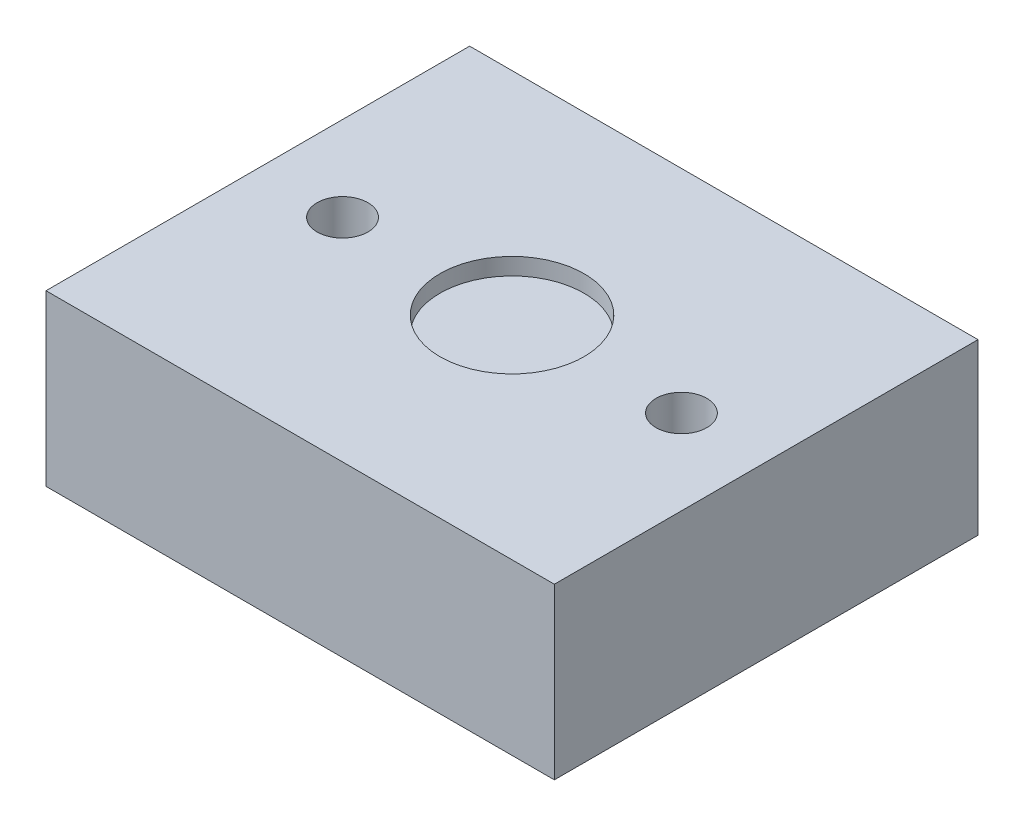
ISO-10303-21;
HEADER;
FILE_DESCRIPTION(('STEP AP214'),'2;1');
FILE_NAME('part.step','',(''),(''),'','','');
FILE_SCHEMA(('AUTOMOTIVE_DESIGN { 1 0 10303 214 1 1 1 1 }'));
ENDSEC;
DATA;
#1=APPLICATION_CONTEXT('core data for automotive mechanical design processes');
#2=APPLICATION_PROTOCOL_DEFINITION('international standard','automotive_design',2000,#1);
#3=PRODUCT_CONTEXT('',#1,'mechanical');
#4=PRODUCT('Part','Part','',(#3));
#5=PRODUCT_RELATED_PRODUCT_CATEGORY('part','',(#4));
#6=PRODUCT_DEFINITION_FORMATION('','',#4);
#7=PRODUCT_DEFINITION_CONTEXT('part definition',#1,'design');
#8=PRODUCT_DEFINITION('design','',#6,#7);
#9=PRODUCT_DEFINITION_SHAPE('','',#8);
#10=(LENGTH_UNIT() NAMED_UNIT(*) SI_UNIT(.MILLI.,.METRE.));
#11=(NAMED_UNIT(*) PLANE_ANGLE_UNIT() SI_UNIT($,.RADIAN.));
#12=(NAMED_UNIT(*) SI_UNIT($,.STERADIAN.) SOLID_ANGLE_UNIT());
#13=UNCERTAINTY_MEASURE_WITH_UNIT(LENGTH_MEASURE(1.E-05),#10,'distance_accuracy_value','');
#14=(GEOMETRIC_REPRESENTATION_CONTEXT(3) GLOBAL_UNCERTAINTY_ASSIGNED_CONTEXT((#13)) GLOBAL_UNIT_ASSIGNED_CONTEXT((#10,
#11,#12)) REPRESENTATION_CONTEXT('',''));
#15=CARTESIAN_POINT('',(0.,0.,0.));
#16=DIRECTION('',(0.,0.,1.));
#17=DIRECTION('',(1.,0.,0.));
#18=AXIS2_PLACEMENT_3D('',#15,#16,#17);
#19=CARTESIAN_POINT('',(0.,10.,0.));
#20=DIRECTION('',(0.,-1.,0.));
#21=DIRECTION('',(0.,0.,-1.));
#22=AXIS2_PLACEMENT_3D('',#19,#20,#21);
#23=PLANE('',#22);
#24=CARTESIAN_POINT('',(0.,10.,0.));
#25=DIRECTION('',(0.,1.,0.));
#26=DIRECTION('',(0.,0.,1.));
#27=AXIS2_PLACEMENT_3D('',#24,#25,#26);
#28=CIRCLE('',#27,4.25);
#29=CARTESIAN_POINT('',(0.,10.,4.25));
#30=VERTEX_POINT('',#29);
#31=EDGE_CURVE('E146',#30,#30,#28,.T.);
#32=ORIENTED_EDGE('',*,*,#31,.F.);
#33=EDGE_LOOP('',(#32));
#34=FACE_BOUND('',#33,.T.);
#35=DIRECTION('',(0.,0.,-1.));
#36=VECTOR('',#35,1.);
#37=CARTESIAN_POINT('',(15.,10.,12.5));
#38=LINE('',#37,#36);
#39=CARTESIAN_POINT('',(15.,10.,12.5));
#40=VERTEX_POINT('',#39);
#41=CARTESIAN_POINT('',(15.,10.,-12.5));
#42=VERTEX_POINT('',#41);
#43=EDGE_CURVE('E92',#40,#42,#38,.T.);
#44=ORIENTED_EDGE('',*,*,#43,.T.);
#45=DIRECTION('',(-1.,0.,0.));
#46=VECTOR('',#45,1.);
#47=CARTESIAN_POINT('',(-15.,10.,-12.5));
#48=LINE('',#47,#46);
#49=CARTESIAN_POINT('',(-15.,10.,-12.5));
#50=VERTEX_POINT('',#49);
#51=EDGE_CURVE('E87',#42,#50,#48,.T.);
#52=ORIENTED_EDGE('',*,*,#51,.T.);
#53=DIRECTION('',(0.,0.,1.));
#54=VECTOR('',#53,1.);
#55=CARTESIAN_POINT('',(-15.,10.,12.5));
#56=LINE('',#55,#54);
#57=CARTESIAN_POINT('',(-15.,10.,12.5));
#58=VERTEX_POINT('',#57);
#59=EDGE_CURVE('E90',#50,#58,#56,.T.);
#60=ORIENTED_EDGE('',*,*,#59,.T.);
#61=DIRECTION('',(1.,0.,0.));
#62=VECTOR('',#61,1.);
#63=CARTESIAN_POINT('',(-15.,10.,12.5));
#64=LINE('',#63,#62);
#65=EDGE_CURVE('E57',#58,#40,#64,.T.);
#66=ORIENTED_EDGE('',*,*,#65,.T.);
#67=EDGE_LOOP('',(#44,#52,#60,#66));
#68=FACE_BOUND('',#67,.T.);
#69=CARTESIAN_POINT('',(10.,10.,0.));
#70=DIRECTION('',(0.,1.,0.));
#71=DIRECTION('',(0.,0.,1.));
#72=AXIS2_PLACEMENT_3D('',#69,#70,#71);
#73=CIRCLE('',#72,1.5);
#74=CARTESIAN_POINT('',(10.,10.,1.5));
#75=VERTEX_POINT('',#74);
#76=EDGE_CURVE('E112',#75,#75,#73,.T.);
#77=ORIENTED_EDGE('',*,*,#76,.F.);
#78=EDGE_LOOP('',(#77));
#79=FACE_BOUND('',#78,.T.);
#80=CARTESIAN_POINT('',(-10.,10.,0.));
#81=DIRECTION('',(0.,1.,0.));
#82=DIRECTION('',(0.,0.,1.));
#83=AXIS2_PLACEMENT_3D('',#80,#81,#82);
#84=CIRCLE('',#83,1.5);
#85=CARTESIAN_POINT('',(-10.,10.,1.5));
#86=VERTEX_POINT('',#85);
#87=EDGE_CURVE('E134',#86,#86,#84,.T.);
#88=ORIENTED_EDGE('',*,*,#87,.F.);
#89=EDGE_LOOP('',(#88));
#90=FACE_BOUND('',#89,.T.);
#91=ADVANCED_FACE('F39',(#34,#68,#79,#90),#23,.F.);
#92=CARTESIAN_POINT('',(0.,0.,0.));
#93=DIRECTION('',(0.,-1.,0.));
#94=DIRECTION('',(0.,0.,-1.));
#95=AXIS2_PLACEMENT_3D('',#92,#93,#94);
#96=PLANE('',#95);
#97=CARTESIAN_POINT('',(10.,0.,0.));
#98=DIRECTION('',(0.,1.,0.));
#99=DIRECTION('',(0.,0.,1.));
#100=AXIS2_PLACEMENT_3D('',#97,#98,#99);
#101=CIRCLE('',#100,1.5);
#102=CARTESIAN_POINT('',(10.,0.,1.5));
#103=VERTEX_POINT('',#102);
#104=EDGE_CURVE('E130',#103,#103,#101,.T.);
#105=ORIENTED_EDGE('',*,*,#104,.T.);
#106=EDGE_LOOP('',(#105));
#107=FACE_BOUND('',#106,.T.);
#108=DIRECTION('',(0.,0.,-1.));
#109=VECTOR('',#108,1.);
#110=CARTESIAN_POINT('',(15.,0.,12.5));
#111=LINE('',#110,#109);
#112=CARTESIAN_POINT('',(15.,0.,12.5));
#113=VERTEX_POINT('',#112);
#114=CARTESIAN_POINT('',(15.,0.,-12.5));
#115=VERTEX_POINT('',#114);
#116=EDGE_CURVE('E108',#113,#115,#111,.T.);
#117=ORIENTED_EDGE('',*,*,#116,.F.);
#118=DIRECTION('',(1.,0.,0.));
#119=VECTOR('',#118,1.);
#120=CARTESIAN_POINT('',(-15.,0.,12.5));
#121=LINE('',#120,#119);
#122=CARTESIAN_POINT('',(-15.,0.,12.5));
#123=VERTEX_POINT('',#122);
#124=EDGE_CURVE('E80',#123,#113,#121,.T.);
#125=ORIENTED_EDGE('',*,*,#124,.F.);
#126=DIRECTION('',(0.,0.,1.));
#127=VECTOR('',#126,1.);
#128=CARTESIAN_POINT('',(-15.,0.,12.5));
#129=LINE('',#128,#127);
#130=CARTESIAN_POINT('',(-15.,0.,-12.5));
#131=VERTEX_POINT('',#130);
#132=EDGE_CURVE('E74',#131,#123,#129,.T.);
#133=ORIENTED_EDGE('',*,*,#132,.F.);
#134=DIRECTION('',(-1.,0.,0.));
#135=VECTOR('',#134,1.);
#136=CARTESIAN_POINT('',(-15.,0.,-12.5));
#137=LINE('',#136,#135);
#138=EDGE_CURVE('E97',#115,#131,#137,.T.);
#139=ORIENTED_EDGE('',*,*,#138,.F.);
#140=EDGE_LOOP('',(#117,#125,#133,#139));
#141=FACE_BOUND('',#140,.T.);
#142=CARTESIAN_POINT('',(-10.,0.,0.));
#143=DIRECTION('',(0.,1.,0.));
#144=DIRECTION('',(0.,0.,1.));
#145=AXIS2_PLACEMENT_3D('',#142,#143,#144);
#146=CIRCLE('',#145,1.5);
#147=CARTESIAN_POINT('',(-10.,0.,1.5));
#148=VERTEX_POINT('',#147);
#149=EDGE_CURVE('E138',#148,#148,#146,.T.);
#150=ORIENTED_EDGE('',*,*,#149,.T.);
#151=EDGE_LOOP('',(#150));
#152=FACE_BOUND('',#151,.T.);
#153=ADVANCED_FACE('F125',(#107,#141,#152),#96,.T.);
#154=CARTESIAN_POINT('',(15.,10.,12.5));
#155=DIRECTION('',(-1.,0.,0.));
#156=DIRECTION('',(0.,0.,1.));
#157=AXIS2_PLACEMENT_3D('',#154,#155,#156);
#158=PLANE('',#157);
#159=ORIENTED_EDGE('',*,*,#116,.T.);
#160=DIRECTION('',(0.,-1.,0.));
#161=VECTOR('',#160,1.);
#162=CARTESIAN_POINT('',(15.,10.,-12.5));
#163=LINE('',#162,#161);
#164=EDGE_CURVE('E11',#42,#115,#163,.T.);
#165=ORIENTED_EDGE('',*,*,#164,.F.);
#166=ORIENTED_EDGE('',*,*,#43,.F.);
#167=DIRECTION('',(0.,-1.,0.));
#168=VECTOR('',#167,1.);
#169=CARTESIAN_POINT('',(15.,10.,12.5));
#170=LINE('',#169,#168);
#171=EDGE_CURVE('E104',#40,#113,#170,.T.);
#172=ORIENTED_EDGE('',*,*,#171,.T.);
#173=EDGE_LOOP('',(#159,#165,#166,#172));
#174=FACE_BOUND('',#173,.T.);
#175=ADVANCED_FACE('F41',(#174),#158,.F.);
#176=CARTESIAN_POINT('',(-15.,10.,-12.5));
#177=DIRECTION('',(0.,0.,1.));
#178=DIRECTION('',(1.,0.,0.));
#179=AXIS2_PLACEMENT_3D('',#176,#177,#178);
#180=PLANE('',#179);
#181=ORIENTED_EDGE('',*,*,#138,.T.);
#182=DIRECTION('',(0.,-1.,0.));
#183=VECTOR('',#182,1.);
#184=CARTESIAN_POINT('',(-15.,10.,-12.5));
#185=LINE('',#184,#183);
#186=EDGE_CURVE('E49',#50,#131,#185,.T.);
#187=ORIENTED_EDGE('',*,*,#186,.F.);
#188=ORIENTED_EDGE('',*,*,#51,.F.);
#189=ORIENTED_EDGE('',*,*,#164,.T.);
#190=EDGE_LOOP('',(#181,#187,#188,#189));
#191=FACE_BOUND('',#190,.T.);
#192=ADVANCED_FACE('F96',(#191),#180,.F.);
#193=CARTESIAN_POINT('',(-15.,10.,12.5));
#194=DIRECTION('',(1.,0.,0.));
#195=DIRECTION('',(0.,0.,-1.));
#196=AXIS2_PLACEMENT_3D('',#193,#194,#195);
#197=PLANE('',#196);
#198=ORIENTED_EDGE('',*,*,#132,.T.);
#199=DIRECTION('',(0.,-1.,0.));
#200=VECTOR('',#199,1.);
#201=CARTESIAN_POINT('',(-15.,10.,12.5));
#202=LINE('',#201,#200);
#203=EDGE_CURVE('E99',#58,#123,#202,.T.);
#204=ORIENTED_EDGE('',*,*,#203,.F.);
#205=ORIENTED_EDGE('',*,*,#59,.F.);
#206=ORIENTED_EDGE('',*,*,#186,.T.);
#207=EDGE_LOOP('',(#198,#204,#205,#206));
#208=FACE_BOUND('',#207,.T.);
#209=ADVANCED_FACE('F100',(#208),#197,.F.);
#210=CARTESIAN_POINT('',(-15.,10.,12.5));
#211=DIRECTION('',(0.,0.,-1.));
#212=DIRECTION('',(-1.,0.,0.));
#213=AXIS2_PLACEMENT_3D('',#210,#211,#212);
#214=PLANE('',#213);
#215=ORIENTED_EDGE('',*,*,#124,.T.);
#216=ORIENTED_EDGE('',*,*,#171,.F.);
#217=ORIENTED_EDGE('',*,*,#65,.F.);
#218=ORIENTED_EDGE('',*,*,#203,.T.);
#219=EDGE_LOOP('',(#215,#216,#217,#218));
#220=FACE_BOUND('',#219,.T.);
#221=ADVANCED_FACE('F122',(#220),#214,.F.);
#222=CARTESIAN_POINT('',(10.,10.,0.));
#223=DIRECTION('',(0.,-1.,0.));
#224=DIRECTION('',(0.,0.,-1.));
#225=AXIS2_PLACEMENT_3D('',#222,#223,#224);
#226=CYLINDRICAL_SURFACE('',#225,1.5);
#227=ORIENTED_EDGE('',*,*,#76,.T.);
#228=EDGE_LOOP('',(#227));
#229=FACE_BOUND('',#228,.T.);
#230=ORIENTED_EDGE('',*,*,#104,.F.);
#231=EDGE_LOOP('',(#230));
#232=FACE_BOUND('',#231,.T.);
#233=ADVANCED_FACE('F171',(#229,#232),#226,.F.);
#234=CARTESIAN_POINT('',(-10.,10.,0.));
#235=DIRECTION('',(0.,-1.,0.));
#236=DIRECTION('',(0.,0.,-1.));
#237=AXIS2_PLACEMENT_3D('',#234,#235,#236);
#238=CYLINDRICAL_SURFACE('',#237,1.5);
#239=ORIENTED_EDGE('',*,*,#87,.T.);
#240=EDGE_LOOP('',(#239));
#241=FACE_BOUND('',#240,.T.);
#242=ORIENTED_EDGE('',*,*,#149,.F.);
#243=EDGE_LOOP('',(#242));
#244=FACE_BOUND('',#243,.T.);
#245=ADVANCED_FACE('F159',(#241,#244),#238,.F.);
#246=CARTESIAN_POINT('',(0.,9.,0.));
#247=DIRECTION('',(0.,1.,0.));
#248=DIRECTION('',(0.,0.,1.));
#249=AXIS2_PLACEMENT_3D('',#246,#247,#248);
#250=CYLINDRICAL_SURFACE('',#249,4.25);
#251=CARTESIAN_POINT('',(0.,9.,0.));
#252=DIRECTION('',(0.,1.,0.));
#253=DIRECTION('',(0.,0.,1.));
#254=AXIS2_PLACEMENT_3D('',#251,#252,#253);
#255=CIRCLE('',#254,4.25);
#256=CARTESIAN_POINT('',(0.,9.,4.25));
#257=VERTEX_POINT('',#256);
#258=EDGE_CURVE('E142',#257,#257,#255,.T.);
#259=ORIENTED_EDGE('',*,*,#258,.F.);
#260=EDGE_LOOP('',(#259));
#261=FACE_BOUND('',#260,.T.);
#262=ORIENTED_EDGE('',*,*,#31,.T.);
#263=EDGE_LOOP('',(#262));
#264=FACE_BOUND('',#263,.T.);
#265=ADVANCED_FACE('F156',(#261,#264),#250,.F.);
#266=CARTESIAN_POINT('',(0.,9.,0.));
#267=DIRECTION('',(0.,1.,0.));
#268=DIRECTION('',(0.,0.,1.));
#269=AXIS2_PLACEMENT_3D('',#266,#267,#268);
#270=PLANE('',#269);
#271=ORIENTED_EDGE('',*,*,#258,.T.);
#272=EDGE_LOOP('',(#271));
#273=FACE_BOUND('',#272,.T.);
#274=ADVANCED_FACE('F154',(#273),#270,.T.);
#275=CLOSED_SHELL('',(#91,#153,#175,#192,#209,#221,#233,#245,#265,#274));
#276=MANIFOLD_SOLID_BREP('B2',#275);
#277=ADVANCED_BREP_SHAPE_REPRESENTATION('',(#18,#276),#14);
#278=SHAPE_DEFINITION_REPRESENTATION(#9,#277);
ENDSEC;
END-ISO-10303-21;
